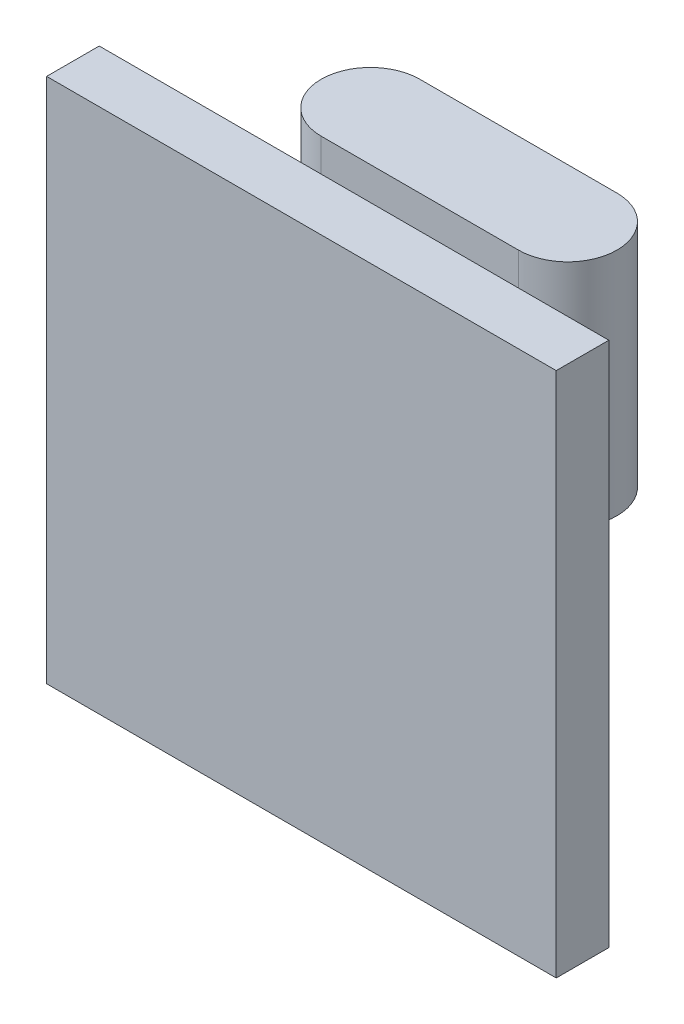
ISO-10303-21;
HEADER;
FILE_DESCRIPTION(('STEP AP214'),'2;1');
FILE_NAME('part.step','',(''),(''),'','','');
FILE_SCHEMA(('AUTOMOTIVE_DESIGN { 1 0 10303 214 1 1 1 1 }'));
ENDSEC;
DATA;
#1=APPLICATION_CONTEXT('core data for automotive mechanical design processes');
#2=APPLICATION_PROTOCOL_DEFINITION('international standard','automotive_design',2000,#1);
#3=PRODUCT_CONTEXT('',#1,'mechanical');
#4=PRODUCT('Part','Part','',(#3));
#5=PRODUCT_RELATED_PRODUCT_CATEGORY('part','',(#4));
#6=PRODUCT_DEFINITION_FORMATION('','',#4);
#7=PRODUCT_DEFINITION_CONTEXT('part definition',#1,'design');
#8=PRODUCT_DEFINITION('design','',#6,#7);
#9=PRODUCT_DEFINITION_SHAPE('','',#8);
#10=(LENGTH_UNIT() NAMED_UNIT(*) SI_UNIT(.MILLI.,.METRE.));
#11=(NAMED_UNIT(*) PLANE_ANGLE_UNIT() SI_UNIT($,.RADIAN.));
#12=(NAMED_UNIT(*) SI_UNIT($,.STERADIAN.) SOLID_ANGLE_UNIT());
#13=UNCERTAINTY_MEASURE_WITH_UNIT(LENGTH_MEASURE(1.E-05),#10,'distance_accuracy_value','');
#14=(GEOMETRIC_REPRESENTATION_CONTEXT(3) GLOBAL_UNCERTAINTY_ASSIGNED_CONTEXT((#13)) GLOBAL_UNIT_ASSIGNED_CONTEXT((#10,
#11,#12)) REPRESENTATION_CONTEXT('',''));
#15=CARTESIAN_POINT('',(0.,0.,0.));
#16=DIRECTION('',(0.,0.,1.));
#17=DIRECTION('',(1.,0.,0.));
#18=AXIS2_PLACEMENT_3D('',#15,#16,#17);
#19=CARTESIAN_POINT('',(0.,0.,0.));
#20=DIRECTION('',(0.,0.,1.));
#21=DIRECTION('',(1.,0.,0.));
#22=AXIS2_PLACEMENT_3D('',#19,#20,#21);
#23=PLANE('',#22);
#24=DIRECTION('',(0.,1.,0.));
#25=VECTOR('',#24,1.);
#26=CARTESIAN_POINT('',(-1.,2.,0.));
#27=LINE('',#26,#25);
#28=CARTESIAN_POINT('',(-1.,2.,0.));
#29=VERTEX_POINT('',#28);
#30=CARTESIAN_POINT('',(-1.,8.,0.));
#31=VERTEX_POINT('',#30);
#32=EDGE_CURVE('E113',#29,#31,#27,.T.);
#33=ORIENTED_EDGE('',*,*,#32,.F.);
#34=DIRECTION('',(1.,0.,0.));
#35=VECTOR('',#34,1.);
#36=CARTESIAN_POINT('',(-1.,2.,0.));
#37=LINE('',#36,#35);
#38=CARTESIAN_POINT('',(5.,2.,0.));
#39=VERTEX_POINT('',#38);
#40=EDGE_CURVE('E52',#29,#39,#37,.T.);
#41=ORIENTED_EDGE('',*,*,#40,.T.);
#42=DIRECTION('',(0.,1.,0.));
#43=VECTOR('',#42,1.);
#44=CARTESIAN_POINT('',(5.,2.,0.));
#45=LINE('',#44,#43);
#46=CARTESIAN_POINT('',(5.,8.,0.));
#47=VERTEX_POINT('',#46);
#48=EDGE_CURVE('E56',#39,#47,#45,.T.);
#49=ORIENTED_EDGE('',*,*,#48,.T.);
#50=DIRECTION('',(1.,0.,0.));
#51=VECTOR('',#50,1.);
#52=CARTESIAN_POINT('',(0.,8.,0.));
#53=LINE('',#52,#51);
#54=CARTESIAN_POINT('',(7.75,8.,0.));
#55=VERTEX_POINT('',#54);
#56=EDGE_CURVE('E164',#47,#55,#53,.T.);
#57=ORIENTED_EDGE('',*,*,#56,.T.);
#58=DIRECTION('',(0.,-1.,0.));
#59=VECTOR('',#58,1.);
#60=CARTESIAN_POINT('',(7.75,0.,0.));
#61=LINE('',#60,#59);
#62=CARTESIAN_POINT('',(7.75,-8.,0.));
#63=VERTEX_POINT('',#62);
#64=EDGE_CURVE('E146',#55,#63,#61,.T.);
#65=ORIENTED_EDGE('',*,*,#64,.T.);
#66=DIRECTION('',(1.,0.,0.));
#67=VECTOR('',#66,1.);
#68=CARTESIAN_POINT('',(0.,-8.,0.));
#69=LINE('',#68,#67);
#70=CARTESIAN_POINT('',(-7.75,-8.,0.));
#71=VERTEX_POINT('',#70);
#72=EDGE_CURVE('E154',#71,#63,#69,.T.);
#73=ORIENTED_EDGE('',*,*,#72,.F.);
#74=DIRECTION('',(0.,-1.,0.));
#75=VECTOR('',#74,1.);
#76=CARTESIAN_POINT('',(-7.75,0.,0.));
#77=LINE('',#76,#75);
#78=CARTESIAN_POINT('',(-7.75,8.,0.));
#79=VERTEX_POINT('',#78);
#80=EDGE_CURVE('E168',#79,#71,#77,.T.);
#81=ORIENTED_EDGE('',*,*,#80,.F.);
#82=EDGE_CURVE('E165',#79,#31,#53,.T.);
#83=ORIENTED_EDGE('',*,*,#82,.T.);
#84=EDGE_LOOP('',(#33,#41,#49,#57,#65,#73,#81,#83));
#85=FACE_BOUND('',#84,.T.);
#86=ADVANCED_FACE('F37',(#85),#23,.F.);
#87=CARTESIAN_POINT('',(7.75,0.,1.6));
#88=DIRECTION('',(1.,0.,0.));
#89=DIRECTION('',(0.,1.,0.));
#90=AXIS2_PLACEMENT_3D('',#87,#88,#89);
#91=PLANE('',#90);
#92=ORIENTED_EDGE('',*,*,#64,.F.);
#93=DIRECTION('',(0.,0.,-1.));
#94=VECTOR('',#93,1.);
#95=CARTESIAN_POINT('',(7.75,8.,1.6));
#96=LINE('',#95,#94);
#97=CARTESIAN_POINT('',(7.75,8.,1.6));
#98=VERTEX_POINT('',#97);
#99=EDGE_CURVE('E11',#98,#55,#96,.T.);
#100=ORIENTED_EDGE('',*,*,#99,.F.);
#101=DIRECTION('',(0.,-1.,0.));
#102=VECTOR('',#101,1.);
#103=CARTESIAN_POINT('',(7.75,0.,1.6));
#104=LINE('',#103,#102);
#105=CARTESIAN_POINT('',(7.75,-8.,1.6));
#106=VERTEX_POINT('',#105);
#107=EDGE_CURVE('E150',#98,#106,#104,.T.);
#108=ORIENTED_EDGE('',*,*,#107,.T.);
#109=DIRECTION('',(0.,0.,-1.));
#110=VECTOR('',#109,1.);
#111=CARTESIAN_POINT('',(7.75,-8.,1.6));
#112=LINE('',#111,#110);
#113=EDGE_CURVE('E161',#106,#63,#112,.T.);
#114=ORIENTED_EDGE('',*,*,#113,.T.);
#115=EDGE_LOOP('',(#92,#100,#108,#114));
#116=FACE_BOUND('',#115,.T.);
#117=ADVANCED_FACE('F39',(#116),#91,.T.);
#118=CARTESIAN_POINT('',(0.,8.,1.6));
#119=DIRECTION('',(0.,1.,0.));
#120=DIRECTION('',(0.,0.,1.));
#121=AXIS2_PLACEMENT_3D('',#118,#119,#120);
#122=PLANE('',#121);
#123=ORIENTED_EDGE('',*,*,#82,.F.);
#124=DIRECTION('',(0.,0.,-1.));
#125=VECTOR('',#124,1.);
#126=CARTESIAN_POINT('',(-7.75,8.,1.6));
#127=LINE('',#126,#125);
#128=CARTESIAN_POINT('',(-7.75,8.,1.6));
#129=VERTEX_POINT('',#128);
#130=EDGE_CURVE('E45',#129,#79,#127,.T.);
#131=ORIENTED_EDGE('',*,*,#130,.F.);
#132=DIRECTION('',(1.,0.,0.));
#133=VECTOR('',#132,1.);
#134=CARTESIAN_POINT('',(0.,8.,1.6));
#135=LINE('',#134,#133);
#136=EDGE_CURVE('E153',#129,#98,#135,.T.);
#137=ORIENTED_EDGE('',*,*,#136,.T.);
#138=ORIENTED_EDGE('',*,*,#99,.T.);
#139=ORIENTED_EDGE('',*,*,#56,.F.);
#140=EDGE_CURVE('E169',#31,#47,#53,.T.);
#141=ORIENTED_EDGE('',*,*,#140,.F.);
#142=EDGE_LOOP('',(#123,#131,#137,#138,#139,#141));
#143=FACE_BOUND('',#142,.T.);
#144=ADVANCED_FACE('F185',(#143),#122,.T.);
#145=CARTESIAN_POINT('',(-7.75,0.,1.6));
#146=DIRECTION('',(1.,0.,0.));
#147=DIRECTION('',(0.,1.,0.));
#148=AXIS2_PLACEMENT_3D('',#145,#146,#147);
#149=PLANE('',#148);
#150=ORIENTED_EDGE('',*,*,#80,.T.);
#151=DIRECTION('',(0.,0.,-1.));
#152=VECTOR('',#151,1.);
#153=CARTESIAN_POINT('',(-7.75,-8.,1.6));
#154=LINE('',#153,#152);
#155=CARTESIAN_POINT('',(-7.75,-8.,1.6));
#156=VERTEX_POINT('',#155);
#157=EDGE_CURVE('E174',#156,#71,#154,.T.);
#158=ORIENTED_EDGE('',*,*,#157,.F.);
#159=DIRECTION('',(0.,-1.,0.));
#160=VECTOR('',#159,1.);
#161=CARTESIAN_POINT('',(-7.75,0.,1.6));
#162=LINE('',#161,#160);
#163=EDGE_CURVE('E157',#129,#156,#162,.T.);
#164=ORIENTED_EDGE('',*,*,#163,.F.);
#165=ORIENTED_EDGE('',*,*,#130,.T.);
#166=EDGE_LOOP('',(#150,#158,#164,#165));
#167=FACE_BOUND('',#166,.T.);
#168=ADVANCED_FACE('F179',(#167),#149,.F.);
#169=CARTESIAN_POINT('',(0.,-8.,1.6));
#170=DIRECTION('',(0.,1.,0.));
#171=DIRECTION('',(0.,0.,1.));
#172=AXIS2_PLACEMENT_3D('',#169,#170,#171);
#173=PLANE('',#172);
#174=ORIENTED_EDGE('',*,*,#72,.T.);
#175=ORIENTED_EDGE('',*,*,#113,.F.);
#176=DIRECTION('',(1.,0.,0.));
#177=VECTOR('',#176,1.);
#178=CARTESIAN_POINT('',(0.,-8.,1.6));
#179=LINE('',#178,#177);
#180=EDGE_CURVE('E159',#156,#106,#179,.T.);
#181=ORIENTED_EDGE('',*,*,#180,.F.);
#182=ORIENTED_EDGE('',*,*,#157,.T.);
#183=EDGE_LOOP('',(#174,#175,#181,#182));
#184=FACE_BOUND('',#183,.T.);
#185=ADVANCED_FACE('F192',(#184),#173,.F.);
#186=CARTESIAN_POINT('',(0.,0.,1.6));
#187=DIRECTION('',(0.,0.,1.));
#188=DIRECTION('',(1.,0.,0.));
#189=AXIS2_PLACEMENT_3D('',#186,#187,#188);
#190=PLANE('',#189);
#191=ORIENTED_EDGE('',*,*,#107,.F.);
#192=ORIENTED_EDGE('',*,*,#136,.F.);
#193=ORIENTED_EDGE('',*,*,#163,.T.);
#194=ORIENTED_EDGE('',*,*,#180,.T.);
#195=EDGE_LOOP('',(#191,#192,#193,#194));
#196=FACE_BOUND('',#195,.T.);
#197=ADVANCED_FACE('F194',(#196),#190,.T.);
#198=CARTESIAN_POINT('',(-1.,2.,-1.5));
#199=DIRECTION('',(0.,1.,0.));
#200=DIRECTION('',(0.,0.,1.));
#201=AXIS2_PLACEMENT_3D('',#198,#199,#200);
#202=CYLINDRICAL_SURFACE('',#201,1.5);
#203=ORIENTED_EDGE('',*,*,#32,.T.);
#204=CARTESIAN_POINT('',(-1.,9.00000000000001,0.));
#205=VERTEX_POINT('',#204);
#206=EDGE_CURVE('E107',#31,#205,#27,.T.);
#207=ORIENTED_EDGE('',*,*,#206,.T.);
#208=CARTESIAN_POINT('',(-1.,9.00000000000001,-1.5));
#209=DIRECTION('',(0.,1.,0.));
#210=DIRECTION('',(0.,0.,1.));
#211=AXIS2_PLACEMENT_3D('',#208,#209,#210);
#212=CIRCLE('',#211,1.5);
#213=CARTESIAN_POINT('',(-1.,9.00000000000001,-3.));
#214=VERTEX_POINT('',#213);
#215=EDGE_CURVE('E111',#214,#205,#212,.T.);
#216=ORIENTED_EDGE('',*,*,#215,.F.);
#217=DIRECTION('',(0.,1.,0.));
#218=VECTOR('',#217,1.);
#219=CARTESIAN_POINT('',(-1.,2.,-3.));
#220=LINE('',#219,#218);
#221=CARTESIAN_POINT('',(-1.,2.,-3.));
#222=VERTEX_POINT('',#221);
#223=EDGE_CURVE('E144',#222,#214,#220,.T.);
#224=ORIENTED_EDGE('',*,*,#223,.F.);
#225=CARTESIAN_POINT('',(-1.,2.,-1.5));
#226=DIRECTION('',(0.,1.,0.));
#227=DIRECTION('',(0.,0.,1.));
#228=AXIS2_PLACEMENT_3D('',#225,#226,#227);
#229=CIRCLE('',#228,1.5);
#230=EDGE_CURVE('E136',#222,#29,#229,.T.);
#231=ORIENTED_EDGE('',*,*,#230,.T.);
#232=EDGE_LOOP('',(#203,#207,#216,#224,#231));
#233=FACE_BOUND('',#232,.T.);
#234=ADVANCED_FACE('F109',(#233),#202,.T.);
#235=CARTESIAN_POINT('',(-1.,2.,-3.));
#236=DIRECTION('',(0.,0.,-1.));
#237=DIRECTION('',(-1.,0.,0.));
#238=AXIS2_PLACEMENT_3D('',#235,#236,#237);
#239=PLANE('',#238);
#240=ORIENTED_EDGE('',*,*,#223,.T.);
#241=DIRECTION('',(-1.,0.,0.));
#242=VECTOR('',#241,1.);
#243=CARTESIAN_POINT('',(-1.,9.00000000000001,-3.));
#244=LINE('',#243,#242);
#245=CARTESIAN_POINT('',(5.,9.00000000000001,-3.));
#246=VERTEX_POINT('',#245);
#247=EDGE_CURVE('E131',#246,#214,#244,.T.);
#248=ORIENTED_EDGE('',*,*,#247,.F.);
#249=DIRECTION('',(0.,1.,0.));
#250=VECTOR('',#249,1.);
#251=CARTESIAN_POINT('',(5.,2.,-3.));
#252=LINE('',#251,#250);
#253=CARTESIAN_POINT('',(5.,2.,-3.));
#254=VERTEX_POINT('',#253);
#255=EDGE_CURVE('E147',#254,#246,#252,.T.);
#256=ORIENTED_EDGE('',*,*,#255,.F.);
#257=DIRECTION('',(-1.,0.,0.));
#258=VECTOR('',#257,1.);
#259=CARTESIAN_POINT('',(-1.,2.,-3.));
#260=LINE('',#259,#258);
#261=EDGE_CURVE('E116',#254,#222,#260,.T.);
#262=ORIENTED_EDGE('',*,*,#261,.T.);
#263=EDGE_LOOP('',(#240,#248,#256,#262));
#264=FACE_BOUND('',#263,.T.);
#265=ADVANCED_FACE('F201',(#264),#239,.T.);
#266=CARTESIAN_POINT('',(5.,2.,-1.5));
#267=DIRECTION('',(0.,1.,0.));
#268=DIRECTION('',(0.,0.,1.));
#269=AXIS2_PLACEMENT_3D('',#266,#267,#268);
#270=CYLINDRICAL_SURFACE('',#269,1.5);
#271=ORIENTED_EDGE('',*,*,#255,.T.);
#272=CARTESIAN_POINT('',(5.,9.00000000000001,-1.5));
#273=DIRECTION('',(0.,1.,0.));
#274=DIRECTION('',(0.,0.,1.));
#275=AXIS2_PLACEMENT_3D('',#272,#273,#274);
#276=CIRCLE('',#275,1.5);
#277=CARTESIAN_POINT('',(5.,9.00000000000001,0.));
#278=VERTEX_POINT('',#277);
#279=EDGE_CURVE('E126',#278,#246,#276,.T.);
#280=ORIENTED_EDGE('',*,*,#279,.F.);
#281=EDGE_CURVE('E122',#47,#278,#45,.T.);
#282=ORIENTED_EDGE('',*,*,#281,.F.);
#283=ORIENTED_EDGE('',*,*,#48,.F.);
#284=CARTESIAN_POINT('',(5.,2.,-1.5));
#285=DIRECTION('',(0.,1.,0.));
#286=DIRECTION('',(0.,0.,1.));
#287=AXIS2_PLACEMENT_3D('',#284,#285,#286);
#288=CIRCLE('',#287,1.5);
#289=EDGE_CURVE('E139',#39,#254,#288,.T.);
#290=ORIENTED_EDGE('',*,*,#289,.T.);
#291=EDGE_LOOP('',(#271,#280,#282,#283,#290));
#292=FACE_BOUND('',#291,.T.);
#293=ADVANCED_FACE('F247',(#292),#270,.T.);
#294=CARTESIAN_POINT('',(-1.,2.,0.));
#295=DIRECTION('',(0.,0.,1.));
#296=DIRECTION('',(1.,0.,0.));
#297=AXIS2_PLACEMENT_3D('',#294,#295,#296);
#298=PLANE('',#297);
#299=ORIENTED_EDGE('',*,*,#206,.F.);
#300=ORIENTED_EDGE('',*,*,#140,.T.);
#301=ORIENTED_EDGE('',*,*,#281,.T.);
#302=DIRECTION('',(1.,0.,0.));
#303=VECTOR('',#302,1.);
#304=CARTESIAN_POINT('',(-1.,9.00000000000001,0.));
#305=LINE('',#304,#303);
#306=EDGE_CURVE('E119',#205,#278,#305,.T.);
#307=ORIENTED_EDGE('',*,*,#306,.F.);
#308=EDGE_LOOP('',(#299,#300,#301,#307));
#309=FACE_BOUND('',#308,.T.);
#310=ADVANCED_FACE('F120',(#309),#298,.T.);
#311=CARTESIAN_POINT('',(-1.,2.,-1.5));
#312=DIRECTION('',(0.,1.,0.));
#313=DIRECTION('',(0.,0.,1.));
#314=AXIS2_PLACEMENT_3D('',#311,#312,#313);
#315=PLANE('',#314);
#316=ORIENTED_EDGE('',*,*,#230,.F.);
#317=ORIENTED_EDGE('',*,*,#261,.F.);
#318=ORIENTED_EDGE('',*,*,#289,.F.);
#319=ORIENTED_EDGE('',*,*,#40,.F.);
#320=EDGE_LOOP('',(#316,#317,#318,#319));
#321=FACE_BOUND('',#320,.T.);
#322=ADVANCED_FACE('F264',(#321),#315,.F.);
#323=CARTESIAN_POINT('',(-1.,9.00000000000001,-1.5));
#324=DIRECTION('',(0.,1.,0.));
#325=DIRECTION('',(0.,0.,1.));
#326=AXIS2_PLACEMENT_3D('',#323,#324,#325);
#327=PLANE('',#326);
#328=ORIENTED_EDGE('',*,*,#215,.T.);
#329=ORIENTED_EDGE('',*,*,#306,.T.);
#330=ORIENTED_EDGE('',*,*,#279,.T.);
#331=ORIENTED_EDGE('',*,*,#247,.T.);
#332=EDGE_LOOP('',(#328,#329,#330,#331));
#333=FACE_BOUND('',#332,.T.);
#334=ADVANCED_FACE('F129',(#333),#327,.T.);
#335=CLOSED_SHELL('',(#86,#117,#144,#168,#185,#197,#234,#265,#293,#310,#322,#334));
#336=MANIFOLD_SOLID_BREP('B2',#335);
#337=ADVANCED_BREP_SHAPE_REPRESENTATION('',(#18,#336),#14);
#338=SHAPE_DEFINITION_REPRESENTATION(#9,#337);
ENDSEC;
END-ISO-10303-21;
